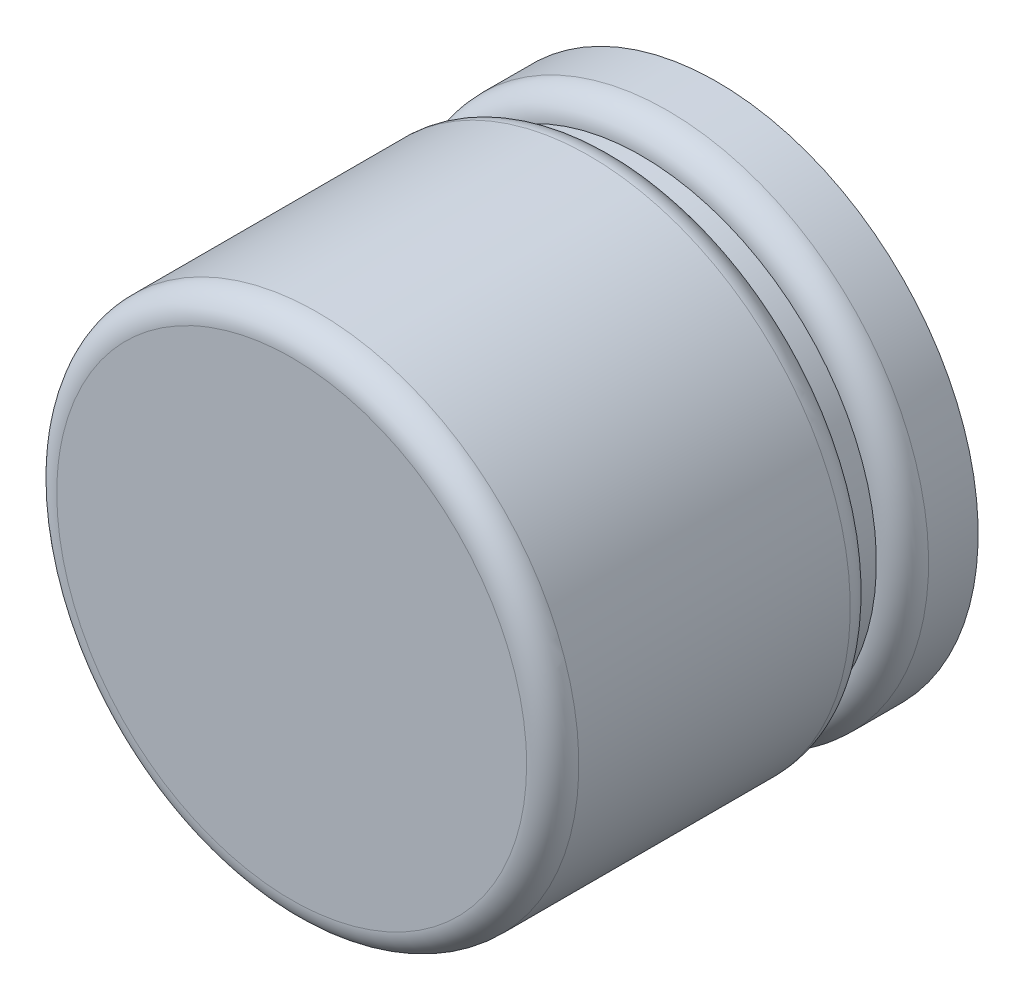
ISO-10303-21;
HEADER;
FILE_DESCRIPTION(('STEP AP214'),'2;1');
FILE_NAME('part.step','',(''),(''),'','','');
FILE_SCHEMA(('AUTOMOTIVE_DESIGN { 1 0 10303 214 1 1 1 1 }'));
ENDSEC;
DATA;
#1=APPLICATION_CONTEXT('core data for automotive mechanical design processes');
#2=APPLICATION_PROTOCOL_DEFINITION('international standard','automotive_design',2000,#1);
#3=PRODUCT_CONTEXT('',#1,'mechanical');
#4=PRODUCT('Part','Part','',(#3));
#5=PRODUCT_RELATED_PRODUCT_CATEGORY('part','',(#4));
#6=PRODUCT_DEFINITION_FORMATION('','',#4);
#7=PRODUCT_DEFINITION_CONTEXT('part definition',#1,'design');
#8=PRODUCT_DEFINITION('design','',#6,#7);
#9=PRODUCT_DEFINITION_SHAPE('','',#8);
#10=(LENGTH_UNIT() NAMED_UNIT(*) SI_UNIT(.MILLI.,.METRE.));
#11=(NAMED_UNIT(*) PLANE_ANGLE_UNIT() SI_UNIT($,.RADIAN.));
#12=(NAMED_UNIT(*) SI_UNIT($,.STERADIAN.) SOLID_ANGLE_UNIT());
#13=UNCERTAINTY_MEASURE_WITH_UNIT(LENGTH_MEASURE(1.E-05),#10,'distance_accuracy_value','');
#14=(GEOMETRIC_REPRESENTATION_CONTEXT(3) GLOBAL_UNCERTAINTY_ASSIGNED_CONTEXT((#13)) GLOBAL_UNIT_ASSIGNED_CONTEXT((#10,
#11,#12)) REPRESENTATION_CONTEXT('',''));
#15=CARTESIAN_POINT('',(0.,0.,0.));
#16=DIRECTION('',(0.,0.,1.));
#17=DIRECTION('',(1.,0.,0.));
#18=AXIS2_PLACEMENT_3D('',#15,#16,#17);
#19=CARTESIAN_POINT('',(-5.99999746,-5.99999746,0.639999985695));
#20=DIRECTION('',(0.,0.,1.));
#21=DIRECTION('',(1.,0.,0.));
#22=AXIS2_PLACEMENT_3D('',#19,#20,#21);
#23=PLANE('',#22);
#24=CARTESIAN_POINT('',(2.54000000055E-06,-1.84279794,0.639999985695));
#25=DIRECTION('',(0.,0.,-1.));
#26=DIRECTION('',(-1.,0.,0.));
#27=AXIS2_PLACEMENT_3D('',#24,#25,#26);
#28=CIRCLE('',#27,2.000000000188);
#29=CARTESIAN_POINT('',(-1.999997460188,-1.84279794,0.639999985695));
#30=VERTEX_POINT('',#29);
#31=EDGE_CURVE('E22',#30,#30,#28,.F.);
#32=ORIENTED_EDGE('',*,*,#31,.F.);
#33=EDGE_LOOP('',(#32));
#34=FACE_BOUND('',#33,.T.);
#35=ADVANCED_FACE('F17',(#34),#23,.F.);
#36=CARTESIAN_POINT('',(2.54000000055E-06,-1.84279794,1.01999996));
#37=DIRECTION('',(0.,0.,-1.));
#38=DIRECTION('',(-1.,0.,0.));
#39=AXIS2_PLACEMENT_3D('',#36,#37,#38);
#40=CYLINDRICAL_SURFACE('',#39,2.000000000188);
#41=ORIENTED_EDGE('',*,*,#31,.T.);
#42=EDGE_LOOP('',(#41));
#43=FACE_BOUND('',#42,.T.);
#44=CARTESIAN_POINT('',(2.54000000004216E-06,-1.84279794,1.01999996));
#45=DIRECTION('',(0.,0.,-1.));
#46=DIRECTION('',(0.,1.,0.));
#47=AXIS2_PLACEMENT_3D('',#44,#45,#46);
#48=CIRCLE('',#47,1.99999999965255);
#49=CARTESIAN_POINT('',(2.54000000004216E-06,0.157202059652549,1.01999996));
#50=VERTEX_POINT('',#49);
#51=EDGE_CURVE('E43',#50,#50,#48,.F.);
#52=ORIENTED_EDGE('',*,*,#51,.F.);
#53=EDGE_LOOP('',(#52));
#54=FACE_BOUND('',#53,.T.);
#55=ADVANCED_FACE('F63',(#43,#54),#40,.T.);
#56=CARTESIAN_POINT('',(2.54000000004216E-06,-1.84279794,1.01999996));
#57=DIRECTION('',(0.,0.,-1.));
#58=DIRECTION('',(0.,1.,0.));
#59=AXIS2_PLACEMENT_3D('',#56,#57,#58);
#60=TOROIDAL_SURFACE('',#59,1.79999999965258,0.199999999999965);
#61=ORIENTED_EDGE('',*,*,#51,.T.);
#62=EDGE_LOOP('',(#61));
#63=FACE_BOUND('',#62,.T.);
#64=CARTESIAN_POINT('',(2.54000000055E-06,-1.84279794,1.21999996));
#65=DIRECTION('',(0.,0.,-1.));
#66=DIRECTION('',(-1.,0.,0.));
#67=AXIS2_PLACEMENT_3D('',#64,#65,#66);
#68=CIRCLE('',#67,1.799999999653);
#69=CARTESIAN_POINT('',(-1.799997459653,-1.84279794,1.21999996));
#70=VERTEX_POINT('',#69);
#71=EDGE_CURVE('E41',#70,#70,#68,.F.);
#72=ORIENTED_EDGE('',*,*,#71,.F.);
#73=EDGE_LOOP('',(#72));
#74=FACE_BOUND('',#73,.T.);
#75=ADVANCED_FACE('F59',(#63,#74),#60,.T.);
#76=CARTESIAN_POINT('',(-2.42999768,0.6200013,3.89999982));
#77=DIRECTION('',(0.,0.,-1.));
#78=DIRECTION('',(-1.,0.,0.));
#79=AXIS2_PLACEMENT_3D('',#76,#77,#78);
#80=PLANE('',#79);
#81=CARTESIAN_POINT('',(2.54000000047584E-06,-1.84279794,3.89999982));
#82=DIRECTION('',(0.,0.,1.));
#83=DIRECTION('',(0.,-1.,0.));
#84=AXIS2_PLACEMENT_3D('',#81,#82,#83);
#85=CIRCLE('',#84,1.800000000188);
#86=CARTESIAN_POINT('',(1.800002540188,-1.84279794000053,3.89999982));
#87=VERTEX_POINT('',#86);
#88=CARTESIAN_POINT('',(-1.799997460188,-1.84279794,3.89999982));
#89=VERTEX_POINT('',#88);
#90=EDGE_CURVE('E34',#87,#89,#85,.F.);
#91=ORIENTED_EDGE('',*,*,#90,.F.);
#92=CARTESIAN_POINT('',(-1.799997460188,-1.84279794,3.89999982));
#93=CARTESIAN_POINT('',(-1.79997846593751,-1.80875734593953,3.89999981940235));
#94=CARTESIAN_POINT('',(-1.79899587415719,-1.7747170785684,3.89999981693248));
#95=CARTESIAN_POINT('',(-1.79511162104202,-1.7067468437002,3.89999981175483));
#96=CARTESIAN_POINT('',(-1.79220999625375,-1.67281687411495,3.89999980904705));
#97=CARTESIAN_POINT('',(-1.78449581926608,-1.60517573413569,3.89999980689983));
#98=CARTESIAN_POINT('',(-1.77968327597388,-1.57146456272254,3.89999980746038));
#99=CARTESIAN_POINT('',(-1.76816212959825,-1.50436454226304,3.89999981116872));
#100=CARTESIAN_POINT('',(-1.76145350808213,-1.47097569635344,3.89999981431654));
#101=CARTESIAN_POINT('',(-1.75162457469155,-1.42833031011706,3.89999981754525));
#102=CARTESIAN_POINT('',(-1.74936371867678,-1.41887062259552,3.89999981821083));
#103=CARTESIAN_POINT('',(-1.74468983051405,-1.39998888747317,3.89999981928339));
#104=CARTESIAN_POINT('',(-1.74227679713952,-1.39056684017637,3.89999981969038));
#105=CARTESIAN_POINT('',(-1.73163618299771,-1.35037696672477,3.89999982048316));
#106=CARTESIAN_POINT('',(-1.7226665048486,-1.31980014961696,3.89999981871546));
#107=CARTESIAN_POINT('',(-1.70800531024628,-1.27432986227567,3.89999981301106));
#108=CARTESIAN_POINT('',(-1.70291681873642,-1.25923810189805,3.89999981060057));
#109=CARTESIAN_POINT('',(-1.69234073914227,-1.2291943193367,3.89999980486516));
#110=CARTESIAN_POINT('',(-1.68685314540695,-1.21424229913498,3.89999980154023));
#111=CARTESIAN_POINT('',(-1.67320860900115,-1.1785383510827,3.89999979257076));
#112=CARTESIAN_POINT('',(-1.66486191334706,-1.15785868168089,3.89999978653036));
#113=CARTESIAN_POINT('',(-1.64740553079934,-1.11682376140855,3.89999977307723));
#114=CARTESIAN_POINT('',(-1.63829582986289,-1.09646851651712,3.89999976566447));
#115=CARTESIAN_POINT('',(-1.61932588412417,-1.05611030145393,3.8999997496977));
#116=CARTESIAN_POINT('',(-1.60946562612914,-1.03610733748191,3.89999974114365));
#117=CARTESIAN_POINT('',(-1.58900820901917,-0.996481444323148,3.89999972311489));
#118=CARTESIAN_POINT('',(-1.5784110375609,-0.976858521509151,3.89999971364016));
#119=CARTESIAN_POINT('',(-1.55649442043757,-0.938019846794878,3.89999969397907));
#120=CARTESIAN_POINT('',(-1.54517496327164,-0.918804101384535,3.89999968379271));
#121=CARTESIAN_POINT('',(-1.52182939389261,-0.880806358956951,3.89999966290744));
#122=CARTESIAN_POINT('',(-1.50980327101183,-0.862024368493551,3.89999965220853));
#123=CARTESIAN_POINT('',(-1.48506103905012,-0.824920195526461,3.89999963048215));
#124=CARTESIAN_POINT('',(-1.47234492012381,-0.806598019589217,3.89999961945468));
#125=CARTESIAN_POINT('',(-1.44624004696306,-0.770438567820351,3.89999959725891));
#126=CARTESIAN_POINT('',(-1.43285128368707,-0.752601298511721,3.8999995860906));
#127=CARTESIAN_POINT('',(-1.40933888867603,-0.722460449608983,3.89999956692807));
#128=CARTESIAN_POINT('',(-1.39937520001804,-0.710031789330433,3.89999955893858));
#129=CARTESIAN_POINT('',(-1.37912150255018,-0.685443646523599,3.89999954310203));
#130=CARTESIAN_POINT('',(-1.36883149093758,-0.673284166308774,3.89999953525498));
#131=CARTESIAN_POINT('',(-1.33748195140313,-0.637221326669943,3.89999951144714));
#132=CARTESIAN_POINT('',(-1.31594142542325,-0.613731654041129,3.89999949521849));
#133=CARTESIAN_POINT('',(-1.28320299338657,-0.579882835836692,3.8999994743821));
#134=CARTESIAN_POINT('',(-1.2724723106977,-0.569066947045425,3.89999946812881));
#135=CARTESIAN_POINT('',(-1.25073851477805,-0.547712025056013,3.89999945875229));
#136=CARTESIAN_POINT('',(-1.23973540147814,-0.537172991928113,3.89999945562904));
#137=CARTESIAN_POINT('',(-1.20911268044773,-0.508581083378854,3.89999945084904));
#138=CARTESIAN_POINT('',(-1.18921912910941,-0.4908201658773,3.89999945204831));
#139=CARTESIAN_POINT('',(-1.14866076300758,-0.456203622610199,3.89999946313505));
#140=CARTESIAN_POINT('',(-1.1279959570625,-0.439347986499158,3.89999947302243));
#141=CARTESIAN_POINT('',(-1.08593575863746,-0.40657494266664,3.89999950032798));
#142=CARTESIAN_POINT('',(-1.06454038003681,-0.390657517136833,3.89999951774602));
#143=CARTESIAN_POINT('',(-1.02106162472674,-0.359792651888722,3.89999955814623));
#144=CARTESIAN_POINT('',(-0.998978266294918,-0.344845186433921,3.89999958112824));
#145=CARTESIAN_POINT('',(-0.957369003517289,-0.318014148112455,3.89999962622576));
#146=CARTESIAN_POINT('',(-0.937928459434872,-0.305997936289878,3.89999964799598));
#147=CARTESIAN_POINT('',(-0.898602768274954,-0.282717689796488,3.89999969108329));
#148=CARTESIAN_POINT('',(-0.878717636685792,-0.271453628976912,3.8999997124004));
#149=CARTESIAN_POINT('',(-0.838532672646908,-0.249693474693614,3.89999975155953));
#150=CARTESIAN_POINT('',(-0.818232856957231,-0.2391973502709,3.89999976940169));
#151=CARTESIAN_POINT('',(-0.777246443441831,-0.218991449814853,3.89999979869767));
#152=CARTESIAN_POINT('',(-0.756559863408541,-0.209281637717591,3.89999981015179));
#153=CARTESIAN_POINT('',(-0.719138852450963,-0.19257184820692,3.89999981984566));
#154=CARTESIAN_POINT('',(-0.702469284715718,-0.185426015453091,3.89999982032364));
#155=CARTESIAN_POINT('',(-0.66450010818888,-0.169815123357912,3.89999981922713));
#156=CARTESIAN_POINT('',(-0.643138960446225,-0.161499229714553,3.89999981707802));
#157=CARTESIAN_POINT('',(-0.595626227989485,-0.144034897639392,3.89999981260328));
#158=CARTESIAN_POINT('',(-0.569405247085684,-0.135074891435718,3.8999998103344));
#159=CARTESIAN_POINT('',(-0.512017898451042,-0.116927921096764,3.89999980677149));
#160=CARTESIAN_POINT('',(-0.480779293022231,-0.107968844192648,3.8999998057134));
#161=CARTESIAN_POINT('',(-0.417994700622,-0.0917845875213735,3.89999980518205));
#162=CARTESIAN_POINT('',(-0.386450554390878,-0.0845522872417161,3.89999980570215));
#163=CARTESIAN_POINT('',(-0.337533239326891,-0.0747141532107915,3.89999980722486));
#164=CARTESIAN_POINT('',(-0.320279133379974,-0.0715054628620235,3.89999980789786));
#165=CARTESIAN_POINT('',(-0.284781432655249,-0.0654389579706539,3.8999998094501));
#166=CARTESIAN_POINT('',(-0.266533185958827,-0.0626081894002398,3.89999981033826));
#167=CARTESIAN_POINT('',(-0.229051420100459,-0.0573823867457498,3.89999981221837));
#168=CARTESIAN_POINT('',(-0.209813920629058,-0.0550159254121061,3.89999981321328));
#169=CARTESIAN_POINT('',(-0.170361878558818,-0.0508077159769987,3.89999981517092));
#170=CARTESIAN_POINT('',(-0.15014412186274,-0.0489960458691738,3.8999998161299));
#171=CARTESIAN_POINT('',(-0.10874545991109,-0.0459906151507691,3.89999981784599));
#172=CARTESIAN_POINT('',(-0.0875622588709934,-0.0448284245447274,3.89999981859203));
#173=CARTESIAN_POINT('',(-0.0442527605364783,-0.0432187780837078,3.89999981967839));
#174=CARTESIAN_POINT('',(-0.0221252328947104,-0.0428043479062116,3.89999981999979));
#175=CARTESIAN_POINT('',(0.0235645374911004,-0.0427911163735539,3.89999982000023));
#176=CARTESIAN_POINT('',(0.0471268130579259,-0.0432469215257228,3.89999981963628));
#177=CARTESIAN_POINT('',(0.0942154633238307,-0.0450837143169699,3.89999981828752));
#178=CARTESIAN_POINT('',(0.117741837624191,-0.0464647121573353,3.89999981730269));
#179=CARTESIAN_POINT('',(0.164722463601538,-0.0501496103681579,3.89999981481293));
#180=CARTESIAN_POINT('',(0.188176714522574,-0.0524535203789716,3.89999981330798));
#181=CARTESIAN_POINT('',(0.234976860925149,-0.0579807508896076,3.89999980987357));
#182=CARTESIAN_POINT('',(0.258322755335432,-0.0612040804595835,3.89999980794411));
#183=CARTESIAN_POINT('',(0.304870155142679,-0.0685651803650829,3.89999980375077));
#184=CARTESIAN_POINT('',(0.328071659196976,-0.0727029591909263,3.89999980148688));
#185=CARTESIAN_POINT('',(0.374294458330978,-0.0818865904632503,3.8999997967093));
#186=CARTESIAN_POINT('',(0.397315751840272,-0.0869324508138551,3.89999979419561));
#187=CARTESIAN_POINT('',(0.443142589994912,-0.0979244709309108,3.89999978899761));
#188=CARTESIAN_POINT('',(0.46594813288594,-0.10387063801128,3.89999978631329));
#189=CARTESIAN_POINT('',(0.511308261967966,-0.116654107530075,3.89999978084775));
#190=CARTESIAN_POINT('',(0.533862846264478,-0.12349141669078,3.89999977806652));
#191=CARTESIAN_POINT('',(0.578686237606825,-0.138046629206943,3.89999977247539));
#192=CARTESIAN_POINT('',(0.600955042661548,-0.145764538694111,3.89999976966549));
#193=CARTESIAN_POINT('',(0.64517249588049,-0.162069050243828,3.89999976407982));
#194=CARTESIAN_POINT('',(0.667121142000179,-0.170655657851091,3.89999976130405));
#195=CARTESIAN_POINT('',(0.710664391834296,-0.188684321845495,3.89999975584396));
#196=CARTESIAN_POINT('',(0.732258993493526,-0.198126383196398,3.89999975315965));
#197=CARTESIAN_POINT('',(0.775060815395131,-0.217851389190348,3.89999974793434));
#198=CARTESIAN_POINT('',(0.7962680336138,-0.22813433822469,3.89999974539336));
#199=CARTESIAN_POINT('',(0.838262347678486,-0.249525254900495,3.89999974050112));
#200=CARTESIAN_POINT('',(0.859049441573738,-0.26063322637167,3.89999973814987));
#201=CARTESIAN_POINT('',(0.900171414714343,-0.283657048553207,3.89999973367806));
#202=CARTESIAN_POINT('',(0.920506292122483,-0.295572902544943,3.8999997315575));
#203=CARTESIAN_POINT('',(0.960692438311227,-0.320194102201059,3.89999972758255));
#204=CARTESIAN_POINT('',(0.980543705407828,-0.332899450614026,3.89999972572817));
#205=CARTESIAN_POINT('',(1.01973198383625,-0.359080031763802,3.89999972231562));
#206=CARTESIAN_POINT('',(1.03906899367585,-0.372555266734218,3.89999972075745));
#207=CARTESIAN_POINT('',(1.07719890467922,-0.400254824171405,3.89999971796188));
#208=CARTESIAN_POINT('',(1.09599180457995,-0.414479148376798,3.89999971672449));
#209=CARTESIAN_POINT('',(1.13300448317802,-0.443654930121904,3.8999997145896));
#210=CARTESIAN_POINT('',(1.1512242608776,-0.458606388927373,3.89999971369209));
#211=CARTESIAN_POINT('',(1.18706256778669,-0.4892133623109,3.89999971225063));
#212=CARTESIAN_POINT('',(1.20468109629842,-0.504868877706022,3.89999971170667));
#213=CARTESIAN_POINT('',(1.23928970627405,-0.536859798980515,3.89999971098048));
#214=CARTESIAN_POINT('',(1.25627978737329,-0.5531952052544,3.89999971079825));
#215=CARTESIAN_POINT('',(1.28960527474641,-0.586520692627533,3.89999971079825));
#216=CARTESIAN_POINT('',(1.30594068102028,-0.603510773726782,3.89999971098048));
#217=CARTESIAN_POINT('',(1.33793160229476,-0.638119383702436,3.89999971170667));
#218=CARTESIAN_POINT('',(1.35358711768987,-0.655737912214168,3.89999971225063));
#219=CARTESIAN_POINT('',(1.38419409107337,-0.691576219123283,3.89999971369209));
#220=CARTESIAN_POINT('',(1.39914554987883,-0.70979599682287,3.8999997145896));
#221=CARTESIAN_POINT('',(1.42832133162392,-0.746808675420951,3.89999971672449));
#222=CARTESIAN_POINT('',(1.4425456558293,-0.765601575321693,3.89999971796188));
#223=CARTESIAN_POINT('',(1.47024521326646,-0.803731486325075,3.89999972075745));
#224=CARTESIAN_POINT('',(1.48372044823687,-0.823068496164688,3.89999972231562));
#225=CARTESIAN_POINT('',(1.50990102938662,-0.86225677459312,3.89999972572817));
#226=CARTESIAN_POINT('',(1.52260637779958,-0.882108041689727,3.89999972758255));
#227=CARTESIAN_POINT('',(1.54722757745567,-0.922294187878486,3.8999997315575));
#228=CARTESIAN_POINT('',(1.55914343144738,-0.942629065286635,3.89999973367806));
#229=CARTESIAN_POINT('',(1.58216725362892,-0.983751038427244,3.89999973814987));
#230=CARTESIAN_POINT('',(1.59327522510012,-1.00453813232249,3.89999974050112));
#231=CARTESIAN_POINT('',(1.6146661417758,-1.04653244638721,3.89999974539336));
#232=CARTESIAN_POINT('',(1.62494909080997,-1.06773966460592,3.89999974793434));
#233=CARTESIAN_POINT('',(1.64467409680431,-1.11054148650744,3.89999975315965));
#234=CARTESIAN_POINT('',(1.65411615815576,-1.13213608816655,3.89999975584396));
#235=CARTESIAN_POINT('',(1.67214482214861,-1.17567933800102,3.89999976130405));
#236=CARTESIAN_POINT('',(1.68073142975378,-1.1976279841212,3.89999976407982));
#237=CARTESIAN_POINT('',(1.69703594130916,-1.24184543733884,3.89999976966549));
#238=CARTESIAN_POINT('',(1.70475385080408,-1.26411424239178,3.89999977247539));
#239=CARTESIAN_POINT('',(1.71930906329899,-1.30893763373901,3.89999977806652));
#240=CARTESIAN_POINT('',(1.72614637243068,-1.33149221804218,3.89999978084775));
#241=CARTESIAN_POINT('',(1.73892984202868,-1.37685234710601,3.89999978631329));
#242=CARTESIAN_POINT('',(1.74487600921727,-1.39965788997218,3.89999978899761));
#243=CARTESIAN_POINT('',(1.75586802903861,-1.44548472819475,3.89999979419561));
#244=CARTESIAN_POINT('',(1.76091388898528,-1.46850602179685,3.8999997967093));
#245=CARTESIAN_POINT('',(1.77009752136109,-1.51472882067732,3.89999980148688));
#246=CARTESIAN_POINT('',(1.77423530169434,-1.53793032438529,3.89999980375076));
#247=CARTESIAN_POINT('',(1.78159639748149,-1.58447772513872,3.89999980794412));
#248=CARTESIAN_POINT('',(1.78481972142578,-1.60782362084149,3.8999998098736));
#249=CARTESIAN_POINT('',(1.79034696730596,-1.65462376371293,3.89999981330795));
#250=CARTESIAN_POINT('',(1.79265089831175,-1.67807800981039,3.89999981481284));
#251=CARTESIAN_POINT('',(1.79633573916336,-1.72505864896593,3.89999981730278));
#252=CARTESIAN_POINT('',(1.79771665865058,-1.74858504126783,3.89999981828784));
#253=CARTESIAN_POINT('',(1.79955366550578,-1.79567364235279,3.89999981963595));
#254=CARTESIAN_POINT('',(1.80000976307097,-1.81923585073808,3.89999981999902));
#255=CARTESIAN_POINT('',(1.800002540188,-1.8427979400008,3.89999982));
#256=B_SPLINE_CURVE_WITH_KNOTS('',3,(#92,#93,#94,#95,#96,#97,#98,#99,#100,#101,#102,#103,#104,
#105,#106,#107,#108,#109,#110,#111,#112,#113,#114,#115,#116,#117,#118,#119,#120,#121,#122,#123,
#124,#125,#126,#127,#128,#129,#130,#131,#132,#133,#134,#135,#136,#137,#138,#139,#140,#141,#142,
#143,#144,#145,#146,#147,#148,#149,#150,#151,#152,#153,#154,#155,#156,#157,#158,#159,#160,#161,
#162,#163,#164,#165,#166,#167,#168,#169,#170,#171,#172,#173,#174,#175,#176,#177,#178,#179,#180,
#181,#182,#183,#184,#185,#186,#187,#188,#189,#190,#191,#192,#193,#194,#195,#196,#197,#198,#199,
#200,#201,#202,#203,#204,#205,#206,#207,#208,#209,#210,#211,#212,#213,#214,#215,#216,#217,#218,
#219,#220,#221,#222,#223,#224,#225,#226,#227,#228,#229,#230,#231,#232,#233,#234,#235,#236,#237,
#238,#239,#240,#241,#242,#243,#244,#245,#246,#247,#248,#249,#250,#251,#252,#253,#254,#255),
.UNSPECIFIED.,.F.,.F.,(4,2,2,2,2,2,2,2,2,2,2,2,2,2,2,2,2,2,2,2,2,2,2,2,2,2,2,2,2,2,2,2,2,2,2,2,
2,2,2,2,2,2,2,2,2,2,2,2,2,2,2,2,2,2,2,2,2,2,2,2,2,2,2,2,2,2,2,2,2,2,2,2,2,2,2,2,2,2,2,2,2,4),
(0.,0.102108744251562,0.204215543973069,0.306321867758237,0.408429184202286,0.437606652886023,
0.466784356771643,0.562324622070954,0.610100021854425,0.657876098239361,0.724761816408849,
0.791648765854524,0.858536891263001,0.925426137320766,0.992316448714178,1.05920777012948,
1.12610004625279,1.19299322177011,1.24077592952733,1.2885590477923,1.38411800958503,
1.42982178136691,1.47552556474459,1.55550241064237,1.63547834237561,1.7154527555834,
1.79542504591673,1.86397208261325,1.93251673500873,2.00105862253464,2.06959736462914,
2.12399989808053,2.19275151168395,2.27585106172156,2.37329750128914,2.47033489008057,
2.52297834661613,2.57836880038025,2.63650632506569,2.69739100476705,2.76102293398253,
2.82740221761526,2.89808391350139,2.96876638874535,3.0394496023283,3.11013351323139,
3.18081808043578,3.25150326292262,3.32218901967306,3.39287530966826,3.46356209188937,
3.53424932531755,3.60493696893396,3.67562498171976,3.74631332265613,3.81700195072422,
3.88769082490522,3.9583799041803,4.02906914753065,4.09975851393744,4.17044796238186,
4.24113745184509,4.31182694130832,4.38251638975274,4.45320575615953,4.52389499950987,
4.59458407878495,4.66527295296595,4.73596158103404,4.8066499219704,4.8773379347562,
4.94802557837261,5.01871281180079,5.08939959402189,5.16008588401709,5.23077164076753,
5.30145682325436,5.37214139045874,5.44282530136183,5.51350851494477,5.58419099018872,
5.65487268607485),.UNSPECIFIED.);
#257=EDGE_CURVE('E36',#89,#87,#256,.T.);
#258=ORIENTED_EDGE('',*,*,#257,.F.);
#259=EDGE_LOOP('',(#91,#258));
#260=FACE_BOUND('',#259,.T.);
#261=ADVANCED_FACE('F37',(#260),#80,.F.);
#262=CARTESIAN_POINT('',(2.54000000055E-06,-1.84279794,1.41999996));
#263=DIRECTION('',(0.,0.,-1.));
#264=DIRECTION('',(-1.,0.,0.));
#265=AXIS2_PLACEMENT_3D('',#262,#263,#264);
#266=CYLINDRICAL_SURFACE('',#265,1.799999999653);
#267=CARTESIAN_POINT('',(2.54000000004736E-06,-1.84279794,1.41999995999886));
#268=DIRECTION('',(0.,0.,-1.));
#269=DIRECTION('',(0.,1.,0.));
#270=AXIS2_PLACEMENT_3D('',#267,#268,#269);
#271=CIRCLE('',#270,1.79999999965258);
#272=CARTESIAN_POINT('',(2.54000000004736E-06,-0.0427979403474154,1.41999995999886));
#273=VERTEX_POINT('',#272);
#274=EDGE_CURVE('E39',#273,#273,#271,.F.);
#275=ORIENTED_EDGE('',*,*,#274,.F.);
#276=EDGE_LOOP('',(#275));
#277=FACE_BOUND('',#276,.T.);
#278=ORIENTED_EDGE('',*,*,#71,.T.);
#279=EDGE_LOOP('',(#278));
#280=FACE_BOUND('',#279,.T.);
#281=ADVANCED_FACE('F86',(#277,#280),#266,.T.);
#282=CARTESIAN_POINT('',(2.54000000047584E-06,-1.84279794000025,3.69999982));
#283=DIRECTION('',(0.,0.,1.));
#284=DIRECTION('',(0.,-1.,0.));
#285=AXIS2_PLACEMENT_3D('',#282,#283,#284);
#286=TOROIDAL_SURFACE('',#285,1.800000000188,0.2);
#287=CARTESIAN_POINT('',(2.54000000055E-06,-1.84279794,3.69999982));
#288=DIRECTION('',(0.,0.,-1.));
#289=DIRECTION('',(-1.,0.,0.));
#290=AXIS2_PLACEMENT_3D('',#287,#288,#289);
#291=CIRCLE('',#290,2.000000000188);
#292=CARTESIAN_POINT('',(-1.999997460188,-1.84279794,3.69999982));
#293=VERTEX_POINT('',#292);
#294=EDGE_CURVE('E28',#293,#293,#291,.T.);
#295=ORIENTED_EDGE('',*,*,#294,.F.);
#296=EDGE_LOOP('',(#295));
#297=FACE_BOUND('',#296,.T.);
#298=ORIENTED_EDGE('',*,*,#257,.T.);
#299=ORIENTED_EDGE('',*,*,#90,.T.);
#300=EDGE_LOOP('',(#298,#299));
#301=FACE_BOUND('',#300,.T.);
#302=ADVANCED_FACE('F19',(#297,#301),#286,.T.);
#303=CARTESIAN_POINT('',(2.54000000004216E-06,-1.84279794,1.61999996));
#304=DIRECTION('',(0.,0.,-1.));
#305=DIRECTION('',(0.,1.,0.));
#306=AXIS2_PLACEMENT_3D('',#303,#304,#305);
#307=TOROIDAL_SURFACE('',#306,1.79999999965258,0.200000000001143);
#308=CARTESIAN_POINT('',(2.54000000055E-06,-1.84279794,1.61999996));
#309=DIRECTION('',(0.,0.,-1.));
#310=DIRECTION('',(-1.,0.,0.));
#311=AXIS2_PLACEMENT_3D('',#308,#309,#310);
#312=CIRCLE('',#311,2.000000000188);
#313=CARTESIAN_POINT('',(-1.999997460188,-1.84279794,1.61999996));
#314=VERTEX_POINT('',#313);
#315=EDGE_CURVE('E11',#314,#314,#312,.F.);
#316=ORIENTED_EDGE('',*,*,#315,.F.);
#317=EDGE_LOOP('',(#316));
#318=FACE_BOUND('',#317,.T.);
#319=ORIENTED_EDGE('',*,*,#274,.T.);
#320=EDGE_LOOP('',(#319));
#321=FACE_BOUND('',#320,.T.);
#322=ADVANCED_FACE('F76',(#318,#321),#307,.T.);
#323=CARTESIAN_POINT('',(2.54000000055E-06,-1.84279794,5.21999996));
#324=DIRECTION('',(0.,0.,-1.));
#325=DIRECTION('',(-1.,0.,0.));
#326=AXIS2_PLACEMENT_3D('',#323,#324,#325);
#327=CYLINDRICAL_SURFACE('',#326,2.000000000188);
#328=ORIENTED_EDGE('',*,*,#315,.T.);
#329=EDGE_LOOP('',(#328));
#330=FACE_BOUND('',#329,.T.);
#331=ORIENTED_EDGE('',*,*,#294,.T.);
#332=EDGE_LOOP('',(#331));
#333=FACE_BOUND('',#332,.T.);
#334=ADVANCED_FACE('F74',(#330,#333),#327,.T.);
#335=CLOSED_SHELL('',(#35,#55,#75,#261,#281,#302,#322,#334));
#336=MANIFOLD_SOLID_BREP('B1',#335);
#337=ADVANCED_BREP_SHAPE_REPRESENTATION('',(#18,#336),#14);
#338=SHAPE_DEFINITION_REPRESENTATION(#9,#337);
ENDSEC;
END-ISO-10303-21;
